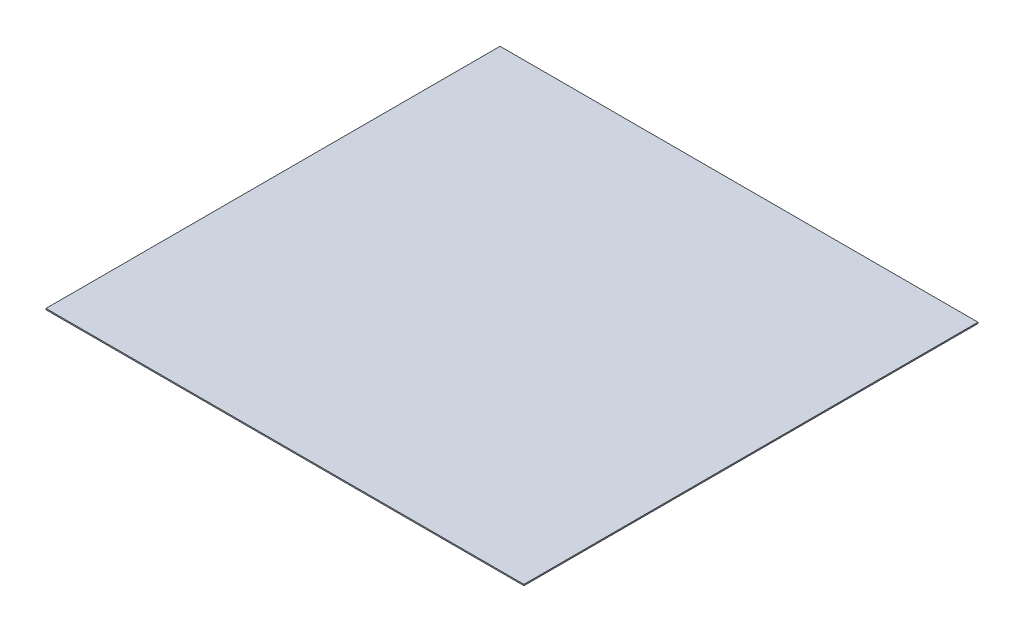
ISO-10303-21;
HEADER;
FILE_DESCRIPTION(('STEP AP214'),'2;1');
FILE_NAME('part.step','',(''),(''),'','','');
FILE_SCHEMA(('AUTOMOTIVE_DESIGN { 1 0 10303 214 1 1 1 1 }'));
ENDSEC;
DATA;
#1=APPLICATION_CONTEXT('core data for automotive mechanical design processes');
#2=APPLICATION_PROTOCOL_DEFINITION('international standard','automotive_design',2000,#1);
#3=PRODUCT_CONTEXT('',#1,'mechanical');
#4=PRODUCT('Part','Part','',(#3));
#5=PRODUCT_RELATED_PRODUCT_CATEGORY('part','',(#4));
#6=PRODUCT_DEFINITION_FORMATION('','',#4);
#7=PRODUCT_DEFINITION_CONTEXT('part definition',#1,'design');
#8=PRODUCT_DEFINITION('design','',#6,#7);
#9=PRODUCT_DEFINITION_SHAPE('','',#8);
#10=(LENGTH_UNIT() NAMED_UNIT(*) SI_UNIT(.MILLI.,.METRE.));
#11=(NAMED_UNIT(*) PLANE_ANGLE_UNIT() SI_UNIT($,.RADIAN.));
#12=(NAMED_UNIT(*) SI_UNIT($,.STERADIAN.) SOLID_ANGLE_UNIT());
#13=UNCERTAINTY_MEASURE_WITH_UNIT(LENGTH_MEASURE(1.E-05),#10,'distance_accuracy_value','');
#14=(GEOMETRIC_REPRESENTATION_CONTEXT(3) GLOBAL_UNCERTAINTY_ASSIGNED_CONTEXT((#13)) GLOBAL_UNIT_ASSIGNED_CONTEXT((#10,
#11,#12)) REPRESENTATION_CONTEXT('',''));
#15=CARTESIAN_POINT('',(0.,0.,0.));
#16=DIRECTION('',(0.,0.,1.));
#17=DIRECTION('',(1.,0.,0.));
#18=AXIS2_PLACEMENT_3D('',#15,#16,#17);
#19=CARTESIAN_POINT('',(-597.537105727262,2.,363.791469194313));
#20=DIRECTION('',(1.,0.,0.));
#21=DIRECTION('',(0.,0.,-1.));
#22=AXIS2_PLACEMENT_3D('',#19,#20,#21);
#23=PLANE('',#22);
#24=DIRECTION('',(0.,0.,1.));
#25=VECTOR('',#24,1.);
#26=CARTESIAN_POINT('',(-597.537105727262,0.,363.791469194313));
#27=LINE('',#26,#25);
#28=CARTESIAN_POINT('',(-597.537105727262,0.,-396.208530805687));
#29=VERTEX_POINT('',#28);
#30=CARTESIAN_POINT('',(-597.537105727262,0.,363.791469194313));
#31=VERTEX_POINT('',#30);
#32=EDGE_CURVE('E99',#29,#31,#27,.T.);
#33=ORIENTED_EDGE('',*,*,#32,.T.);
#34=DIRECTION('',(0.,-1.,0.));
#35=VECTOR('',#34,1.);
#36=CARTESIAN_POINT('',(-597.537105727262,2.,363.791469194313));
#37=LINE('',#36,#35);
#38=CARTESIAN_POINT('',(-597.537105727262,2.,363.791469194313));
#39=VERTEX_POINT('',#38);
#40=EDGE_CURVE('E11',#39,#31,#37,.T.);
#41=ORIENTED_EDGE('',*,*,#40,.F.);
#42=DIRECTION('',(0.,0.,1.));
#43=VECTOR('',#42,1.);
#44=CARTESIAN_POINT('',(-597.537105727262,2.,363.791469194313));
#45=LINE('',#44,#43);
#46=CARTESIAN_POINT('',(-597.537105727262,2.,-396.208530805687));
#47=VERTEX_POINT('',#46);
#48=EDGE_CURVE('E87',#47,#39,#45,.T.);
#49=ORIENTED_EDGE('',*,*,#48,.F.);
#50=DIRECTION('',(0.,-1.,0.));
#51=VECTOR('',#50,1.);
#52=CARTESIAN_POINT('',(-597.537105727262,2.,-396.208530805687));
#53=LINE('',#52,#51);
#54=EDGE_CURVE('E95',#47,#29,#53,.T.);
#55=ORIENTED_EDGE('',*,*,#54,.T.);
#56=EDGE_LOOP('',(#33,#41,#49,#55));
#57=FACE_BOUND('',#56,.T.);
#58=ADVANCED_FACE('F36',(#57),#23,.F.);
#59=CARTESIAN_POINT('',(-597.537105727262,2.,363.791469194313));
#60=DIRECTION('',(0.,0.,-1.));
#61=DIRECTION('',(-1.,0.,0.));
#62=AXIS2_PLACEMENT_3D('',#59,#60,#61);
#63=PLANE('',#62);
#64=DIRECTION('',(1.,0.,0.));
#65=VECTOR('',#64,1.);
#66=CARTESIAN_POINT('',(-597.537105727262,0.,363.791469194313));
#67=LINE('',#66,#65);
#68=CARTESIAN_POINT('',(202.462894272738,0.,363.791469194313));
#69=VERTEX_POINT('',#68);
#70=EDGE_CURVE('E91',#31,#69,#67,.T.);
#71=ORIENTED_EDGE('',*,*,#70,.T.);
#72=DIRECTION('',(0.,-1.,0.));
#73=VECTOR('',#72,1.);
#74=CARTESIAN_POINT('',(202.462894272738,2.,363.791469194313));
#75=LINE('',#74,#73);
#76=CARTESIAN_POINT('',(202.462894272738,2.,363.791469194313));
#77=VERTEX_POINT('',#76);
#78=EDGE_CURVE('E44',#77,#69,#75,.T.);
#79=ORIENTED_EDGE('',*,*,#78,.F.);
#80=DIRECTION('',(1.,0.,0.));
#81=VECTOR('',#80,1.);
#82=CARTESIAN_POINT('',(-597.537105727262,2.,363.791469194313));
#83=LINE('',#82,#81);
#84=EDGE_CURVE('E82',#39,#77,#83,.T.);
#85=ORIENTED_EDGE('',*,*,#84,.F.);
#86=ORIENTED_EDGE('',*,*,#40,.T.);
#87=EDGE_LOOP('',(#71,#79,#85,#86));
#88=FACE_BOUND('',#87,.T.);
#89=ADVANCED_FACE('F90',(#88),#63,.F.);
#90=CARTESIAN_POINT('',(202.462894272738,2.,363.791469194313));
#91=DIRECTION('',(-1.,0.,0.));
#92=DIRECTION('',(0.,0.,1.));
#93=AXIS2_PLACEMENT_3D('',#90,#91,#92);
#94=PLANE('',#93);
#95=DIRECTION('',(0.,0.,-1.));
#96=VECTOR('',#95,1.);
#97=CARTESIAN_POINT('',(202.462894272738,0.,363.791469194313));
#98=LINE('',#97,#96);
#99=CARTESIAN_POINT('',(202.462894272738,0.,-396.208530805687));
#100=VERTEX_POINT('',#99);
#101=EDGE_CURVE('E69',#69,#100,#98,.T.);
#102=ORIENTED_EDGE('',*,*,#101,.T.);
#103=DIRECTION('',(0.,-1.,0.));
#104=VECTOR('',#103,1.);
#105=CARTESIAN_POINT('',(202.462894272738,2.,-396.208530805687));
#106=LINE('',#105,#104);
#107=CARTESIAN_POINT('',(202.462894272738,2.,-396.208530805687));
#108=VERTEX_POINT('',#107);
#109=EDGE_CURVE('E92',#108,#100,#106,.T.);
#110=ORIENTED_EDGE('',*,*,#109,.F.);
#111=DIRECTION('',(0.,0.,-1.));
#112=VECTOR('',#111,1.);
#113=CARTESIAN_POINT('',(202.462894272738,2.,363.791469194313));
#114=LINE('',#113,#112);
#115=EDGE_CURVE('E85',#77,#108,#114,.T.);
#116=ORIENTED_EDGE('',*,*,#115,.F.);
#117=ORIENTED_EDGE('',*,*,#78,.T.);
#118=EDGE_LOOP('',(#102,#110,#116,#117));
#119=FACE_BOUND('',#118,.T.);
#120=ADVANCED_FACE('F93',(#119),#94,.F.);
#121=CARTESIAN_POINT('',(-597.537105727262,2.,-396.208530805687));
#122=DIRECTION('',(0.,0.,1.));
#123=DIRECTION('',(1.,0.,0.));
#124=AXIS2_PLACEMENT_3D('',#121,#122,#123);
#125=PLANE('',#124);
#126=DIRECTION('',(-1.,0.,0.));
#127=VECTOR('',#126,1.);
#128=CARTESIAN_POINT('',(-597.537105727262,0.,-396.208530805687));
#129=LINE('',#128,#127);
#130=EDGE_CURVE('E75',#100,#29,#129,.T.);
#131=ORIENTED_EDGE('',*,*,#130,.T.);
#132=ORIENTED_EDGE('',*,*,#54,.F.);
#133=DIRECTION('',(-1.,0.,0.));
#134=VECTOR('',#133,1.);
#135=CARTESIAN_POINT('',(-597.537105727262,2.,-396.208530805687));
#136=LINE('',#135,#134);
#137=EDGE_CURVE('E52',#108,#47,#136,.T.);
#138=ORIENTED_EDGE('',*,*,#137,.F.);
#139=ORIENTED_EDGE('',*,*,#109,.T.);
#140=EDGE_LOOP('',(#131,#132,#138,#139));
#141=FACE_BOUND('',#140,.T.);
#142=ADVANCED_FACE('F106',(#141),#125,.F.);
#143=CARTESIAN_POINT('',(0.,2.,0.));
#144=DIRECTION('',(0.,-1.,0.));
#145=DIRECTION('',(0.,0.,-1.));
#146=AXIS2_PLACEMENT_3D('',#143,#144,#145);
#147=PLANE('',#146);
#148=ORIENTED_EDGE('',*,*,#48,.T.);
#149=ORIENTED_EDGE('',*,*,#84,.T.);
#150=ORIENTED_EDGE('',*,*,#115,.T.);
#151=ORIENTED_EDGE('',*,*,#137,.T.);
#152=EDGE_LOOP('',(#148,#149,#150,#151));
#153=FACE_BOUND('',#152,.T.);
#154=ADVANCED_FACE('F83',(#153),#147,.F.);
#155=CARTESIAN_POINT('',(0.,0.,0.));
#156=DIRECTION('',(0.,-1.,0.));
#157=DIRECTION('',(0.,0.,-1.));
#158=AXIS2_PLACEMENT_3D('',#155,#156,#157);
#159=PLANE('',#158);
#160=ORIENTED_EDGE('',*,*,#32,.F.);
#161=ORIENTED_EDGE('',*,*,#130,.F.);
#162=ORIENTED_EDGE('',*,*,#101,.F.);
#163=ORIENTED_EDGE('',*,*,#70,.F.);
#164=EDGE_LOOP('',(#160,#161,#162,#163));
#165=FACE_BOUND('',#164,.T.);
#166=ADVANCED_FACE('F109',(#165),#159,.T.);
#167=CLOSED_SHELL('',(#58,#89,#120,#142,#154,#166));
#168=MANIFOLD_SOLID_BREP('B2',#167);
#169=ADVANCED_BREP_SHAPE_REPRESENTATION('',(#18,#168),#14);
#170=SHAPE_DEFINITION_REPRESENTATION(#9,#169);
ENDSEC;
END-ISO-10303-21;
